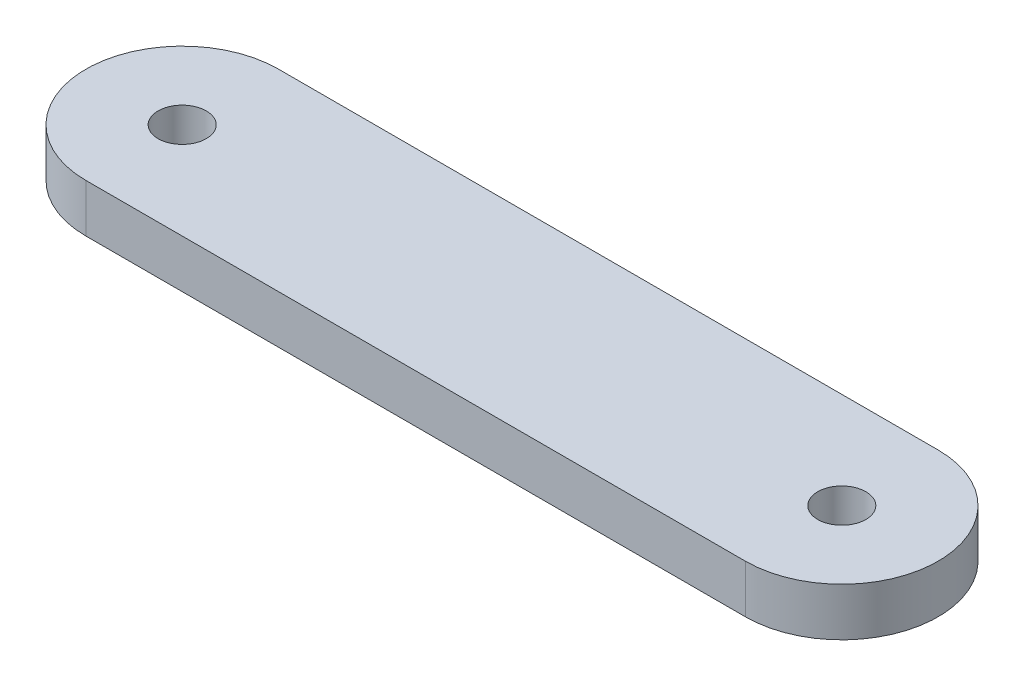
ISO-10303-21;
HEADER;
FILE_DESCRIPTION(('STEP AP214'),'2;1');
FILE_NAME('part.step','',(''),(''),'','','');
FILE_SCHEMA(('AUTOMOTIVE_DESIGN { 1 0 10303 214 1 1 1 1 }'));
ENDSEC;
DATA;
#1=APPLICATION_CONTEXT('core data for automotive mechanical design processes');
#2=APPLICATION_PROTOCOL_DEFINITION('international standard','automotive_design',2000,#1);
#3=PRODUCT_CONTEXT('',#1,'mechanical');
#4=PRODUCT('Part','Part','',(#3));
#5=PRODUCT_RELATED_PRODUCT_CATEGORY('part','',(#4));
#6=PRODUCT_DEFINITION_FORMATION('','',#4);
#7=PRODUCT_DEFINITION_CONTEXT('part definition',#1,'design');
#8=PRODUCT_DEFINITION('design','',#6,#7);
#9=PRODUCT_DEFINITION_SHAPE('','',#8);
#10=(LENGTH_UNIT() NAMED_UNIT(*) SI_UNIT(.MILLI.,.METRE.));
#11=(NAMED_UNIT(*) PLANE_ANGLE_UNIT() SI_UNIT($,.RADIAN.));
#12=(NAMED_UNIT(*) SI_UNIT($,.STERADIAN.) SOLID_ANGLE_UNIT());
#13=UNCERTAINTY_MEASURE_WITH_UNIT(LENGTH_MEASURE(1.E-05),#10,'distance_accuracy_value','');
#14=(GEOMETRIC_REPRESENTATION_CONTEXT(3) GLOBAL_UNCERTAINTY_ASSIGNED_CONTEXT((#13)) GLOBAL_UNIT_ASSIGNED_CONTEXT((#10,
#11,#12)) REPRESENTATION_CONTEXT('',''));
#15=CARTESIAN_POINT('',(0.,0.,0.));
#16=DIRECTION('',(0.,0.,1.));
#17=DIRECTION('',(1.,0.,0.));
#18=AXIS2_PLACEMENT_3D('',#15,#16,#17);
#19=CARTESIAN_POINT('',(0.,3.175,0.));
#20=DIRECTION('',(0.,1.,0.));
#21=DIRECTION('',(0.,0.,1.));
#22=AXIS2_PLACEMENT_3D('',#19,#20,#21);
#23=PLANE('',#22);
#24=CARTESIAN_POINT('',(0.,3.175,0.));
#25=DIRECTION('',(0.,1.,0.));
#26=DIRECTION('',(0.,0.,1.));
#27=AXIS2_PLACEMENT_3D('',#24,#25,#26);
#28=CIRCLE('',#27,1.5875);
#29=CARTESIAN_POINT('',(0.,3.175,1.5875));
#30=VERTEX_POINT('',#29);
#31=EDGE_CURVE('E99',#30,#30,#28,.T.);
#32=ORIENTED_EDGE('',*,*,#31,.F.);
#33=EDGE_LOOP('',(#32));
#34=FACE_BOUND('',#33,.T.);
#35=CARTESIAN_POINT('',(0.,3.175,0.));
#36=DIRECTION('',(0.,1.,0.));
#37=DIRECTION('',(0.,0.,1.));
#38=AXIS2_PLACEMENT_3D('',#35,#36,#37);
#39=CIRCLE('',#38,6.35);
#40=CARTESIAN_POINT('',(0.,3.175,-6.35));
#41=VERTEX_POINT('',#40);
#42=CARTESIAN_POINT('',(0.,3.175,6.35));
#43=VERTEX_POINT('',#42);
#44=EDGE_CURVE('E84',#41,#43,#39,.T.);
#45=ORIENTED_EDGE('',*,*,#44,.T.);
#46=DIRECTION('',(1.,0.,0.));
#47=VECTOR('',#46,1.);
#48=CARTESIAN_POINT('',(0.,3.175,6.35));
#49=LINE('',#48,#47);
#50=CARTESIAN_POINT('',(43.472608,3.175,6.35));
#51=VERTEX_POINT('',#50);
#52=EDGE_CURVE('E79',#43,#51,#49,.T.);
#53=ORIENTED_EDGE('',*,*,#52,.T.);
#54=CARTESIAN_POINT('',(43.472608,3.175,0.));
#55=DIRECTION('',(0.,1.,0.));
#56=DIRECTION('',(0.,0.,1.));
#57=AXIS2_PLACEMENT_3D('',#54,#55,#56);
#58=CIRCLE('',#57,6.35);
#59=CARTESIAN_POINT('',(43.472608,3.175,-6.35));
#60=VERTEX_POINT('',#59);
#61=EDGE_CURVE('E82',#51,#60,#58,.T.);
#62=ORIENTED_EDGE('',*,*,#61,.T.);
#63=DIRECTION('',(-1.,0.,0.));
#64=VECTOR('',#63,1.);
#65=CARTESIAN_POINT('',(0.,3.175,-6.35));
#66=LINE('',#65,#64);
#67=EDGE_CURVE('E49',#60,#41,#66,.T.);
#68=ORIENTED_EDGE('',*,*,#67,.T.);
#69=EDGE_LOOP('',(#45,#53,#62,#68));
#70=FACE_BOUND('',#69,.T.);
#71=CARTESIAN_POINT('',(43.472608,3.175,0.));
#72=DIRECTION('',(0.,1.,0.));
#73=DIRECTION('',(0.,0.,1.));
#74=AXIS2_PLACEMENT_3D('',#71,#72,#73);
#75=CIRCLE('',#74,1.5875);
#76=CARTESIAN_POINT('',(43.472608,3.175,1.5875));
#77=VERTEX_POINT('',#76);
#78=EDGE_CURVE('E114',#77,#77,#75,.T.);
#79=ORIENTED_EDGE('',*,*,#78,.F.);
#80=EDGE_LOOP('',(#79));
#81=FACE_BOUND('',#80,.T.);
#82=ADVANCED_FACE('F32',(#34,#70,#81),#23,.T.);
#83=CARTESIAN_POINT('',(0.,0.,0.));
#84=DIRECTION('',(0.,1.,0.));
#85=DIRECTION('',(0.,0.,1.));
#86=AXIS2_PLACEMENT_3D('',#83,#84,#85);
#87=PLANE('',#86);
#88=CARTESIAN_POINT('',(0.,0.,0.));
#89=DIRECTION('',(0.,1.,0.));
#90=DIRECTION('',(0.,0.,1.));
#91=AXIS2_PLACEMENT_3D('',#88,#89,#90);
#92=CIRCLE('',#91,6.35);
#93=CARTESIAN_POINT('',(0.,0.,-6.35));
#94=VERTEX_POINT('',#93);
#95=CARTESIAN_POINT('',(0.,0.,6.35));
#96=VERTEX_POINT('',#95);
#97=EDGE_CURVE('E96',#94,#96,#92,.T.);
#98=ORIENTED_EDGE('',*,*,#97,.F.);
#99=DIRECTION('',(-1.,0.,0.));
#100=VECTOR('',#99,1.);
#101=CARTESIAN_POINT('',(0.,0.,-6.35));
#102=LINE('',#101,#100);
#103=CARTESIAN_POINT('',(43.472608,0.,-6.35));
#104=VERTEX_POINT('',#103);
#105=EDGE_CURVE('E72',#104,#94,#102,.T.);
#106=ORIENTED_EDGE('',*,*,#105,.F.);
#107=CARTESIAN_POINT('',(43.472608,0.,0.));
#108=DIRECTION('',(0.,1.,0.));
#109=DIRECTION('',(0.,0.,1.));
#110=AXIS2_PLACEMENT_3D('',#107,#108,#109);
#111=CIRCLE('',#110,6.35);
#112=CARTESIAN_POINT('',(43.472608,0.,6.35));
#113=VERTEX_POINT('',#112);
#114=EDGE_CURVE('E66',#113,#104,#111,.T.);
#115=ORIENTED_EDGE('',*,*,#114,.F.);
#116=DIRECTION('',(1.,0.,0.));
#117=VECTOR('',#116,1.);
#118=CARTESIAN_POINT('',(0.,0.,6.35));
#119=LINE('',#118,#117);
#120=EDGE_CURVE('E88',#96,#113,#119,.T.);
#121=ORIENTED_EDGE('',*,*,#120,.F.);
#122=EDGE_LOOP('',(#98,#106,#115,#121));
#123=FACE_BOUND('',#122,.T.);
#124=CARTESIAN_POINT('',(0.,0.,0.));
#125=DIRECTION('',(0.,1.,0.));
#126=DIRECTION('',(0.,0.,1.));
#127=AXIS2_PLACEMENT_3D('',#124,#125,#126);
#128=CIRCLE('',#127,1.5875);
#129=CARTESIAN_POINT('',(0.,0.,1.5875));
#130=VERTEX_POINT('',#129);
#131=EDGE_CURVE('E111',#130,#130,#128,.T.);
#132=ORIENTED_EDGE('',*,*,#131,.T.);
#133=EDGE_LOOP('',(#132));
#134=FACE_BOUND('',#133,.T.);
#135=CARTESIAN_POINT('',(43.472608,0.,0.));
#136=DIRECTION('',(0.,1.,0.));
#137=DIRECTION('',(0.,0.,1.));
#138=AXIS2_PLACEMENT_3D('',#135,#136,#137);
#139=CIRCLE('',#138,1.5875);
#140=CARTESIAN_POINT('',(43.472608,0.,1.5875));
#141=VERTEX_POINT('',#140);
#142=EDGE_CURVE('E117',#141,#141,#139,.T.);
#143=ORIENTED_EDGE('',*,*,#142,.T.);
#144=EDGE_LOOP('',(#143));
#145=FACE_BOUND('',#144,.T.);
#146=ADVANCED_FACE('F107',(#123,#134,#145),#87,.F.);
#147=CARTESIAN_POINT('',(0.,3.175,0.));
#148=DIRECTION('',(0.,-1.,0.));
#149=DIRECTION('',(0.,0.,-1.));
#150=AXIS2_PLACEMENT_3D('',#147,#148,#149);
#151=CYLINDRICAL_SURFACE('',#150,6.35);
#152=ORIENTED_EDGE('',*,*,#97,.T.);
#153=DIRECTION('',(0.,-1.,0.));
#154=VECTOR('',#153,1.);
#155=CARTESIAN_POINT('',(0.,3.175,6.35));
#156=LINE('',#155,#154);
#157=EDGE_CURVE('E11',#43,#96,#156,.T.);
#158=ORIENTED_EDGE('',*,*,#157,.F.);
#159=ORIENTED_EDGE('',*,*,#44,.F.);
#160=DIRECTION('',(0.,-1.,0.));
#161=VECTOR('',#160,1.);
#162=CARTESIAN_POINT('',(0.,3.175,-6.35));
#163=LINE('',#162,#161);
#164=EDGE_CURVE('E92',#41,#94,#163,.T.);
#165=ORIENTED_EDGE('',*,*,#164,.T.);
#166=EDGE_LOOP('',(#152,#158,#159,#165));
#167=FACE_BOUND('',#166,.T.);
#168=ADVANCED_FACE('F34',(#167),#151,.T.);
#169=CARTESIAN_POINT('',(0.,3.175,6.35));
#170=DIRECTION('',(0.,0.,-1.));
#171=DIRECTION('',(-1.,0.,0.));
#172=AXIS2_PLACEMENT_3D('',#169,#170,#171);
#173=PLANE('',#172);
#174=ORIENTED_EDGE('',*,*,#120,.T.);
#175=DIRECTION('',(0.,-1.,0.));
#176=VECTOR('',#175,1.);
#177=CARTESIAN_POINT('',(43.472608,3.175,6.35));
#178=LINE('',#177,#176);
#179=EDGE_CURVE('E41',#51,#113,#178,.T.);
#180=ORIENTED_EDGE('',*,*,#179,.F.);
#181=ORIENTED_EDGE('',*,*,#52,.F.);
#182=ORIENTED_EDGE('',*,*,#157,.T.);
#183=EDGE_LOOP('',(#174,#180,#181,#182));
#184=FACE_BOUND('',#183,.T.);
#185=ADVANCED_FACE('F87',(#184),#173,.F.);
#186=CARTESIAN_POINT('',(43.472608,3.175,0.));
#187=DIRECTION('',(0.,-1.,0.));
#188=DIRECTION('',(0.,0.,-1.));
#189=AXIS2_PLACEMENT_3D('',#186,#187,#188);
#190=CYLINDRICAL_SURFACE('',#189,6.35);
#191=ORIENTED_EDGE('',*,*,#114,.T.);
#192=DIRECTION('',(0.,-1.,0.));
#193=VECTOR('',#192,1.);
#194=CARTESIAN_POINT('',(43.472608,3.175,-6.35));
#195=LINE('',#194,#193);
#196=EDGE_CURVE('E89',#60,#104,#195,.T.);
#197=ORIENTED_EDGE('',*,*,#196,.F.);
#198=ORIENTED_EDGE('',*,*,#61,.F.);
#199=ORIENTED_EDGE('',*,*,#179,.T.);
#200=EDGE_LOOP('',(#191,#197,#198,#199));
#201=FACE_BOUND('',#200,.T.);
#202=ADVANCED_FACE('F90',(#201),#190,.T.);
#203=CARTESIAN_POINT('',(0.,3.175,-6.35));
#204=DIRECTION('',(0.,0.,1.));
#205=DIRECTION('',(1.,0.,0.));
#206=AXIS2_PLACEMENT_3D('',#203,#204,#205);
#207=PLANE('',#206);
#208=ORIENTED_EDGE('',*,*,#105,.T.);
#209=ORIENTED_EDGE('',*,*,#164,.F.);
#210=ORIENTED_EDGE('',*,*,#67,.F.);
#211=ORIENTED_EDGE('',*,*,#196,.T.);
#212=EDGE_LOOP('',(#208,#209,#210,#211));
#213=FACE_BOUND('',#212,.T.);
#214=ADVANCED_FACE('F104',(#213),#207,.F.);
#215=CARTESIAN_POINT('',(0.,3.175,0.));
#216=DIRECTION('',(0.,-1.,0.));
#217=DIRECTION('',(0.,0.,-1.));
#218=AXIS2_PLACEMENT_3D('',#215,#216,#217);
#219=CYLINDRICAL_SURFACE('',#218,1.5875);
#220=ORIENTED_EDGE('',*,*,#31,.T.);
#221=EDGE_LOOP('',(#220));
#222=FACE_BOUND('',#221,.T.);
#223=ORIENTED_EDGE('',*,*,#131,.F.);
#224=EDGE_LOOP('',(#223));
#225=FACE_BOUND('',#224,.T.);
#226=ADVANCED_FACE('F134',(#222,#225),#219,.F.);
#227=CARTESIAN_POINT('',(43.472608,3.175,0.));
#228=DIRECTION('',(0.,-1.,0.));
#229=DIRECTION('',(0.,0.,-1.));
#230=AXIS2_PLACEMENT_3D('',#227,#228,#229);
#231=CYLINDRICAL_SURFACE('',#230,1.5875);
#232=ORIENTED_EDGE('',*,*,#78,.T.);
#233=EDGE_LOOP('',(#232));
#234=FACE_BOUND('',#233,.T.);
#235=ORIENTED_EDGE('',*,*,#142,.F.);
#236=EDGE_LOOP('',(#235));
#237=FACE_BOUND('',#236,.T.);
#238=ADVANCED_FACE('F123',(#234,#237),#231,.F.);
#239=CLOSED_SHELL('',(#82,#146,#168,#185,#202,#214,#226,#238));
#240=MANIFOLD_SOLID_BREP('B2',#239);
#241=ADVANCED_BREP_SHAPE_REPRESENTATION('',(#18,#240),#14);
#242=SHAPE_DEFINITION_REPRESENTATION(#9,#241);
ENDSEC;
END-ISO-10303-21;
